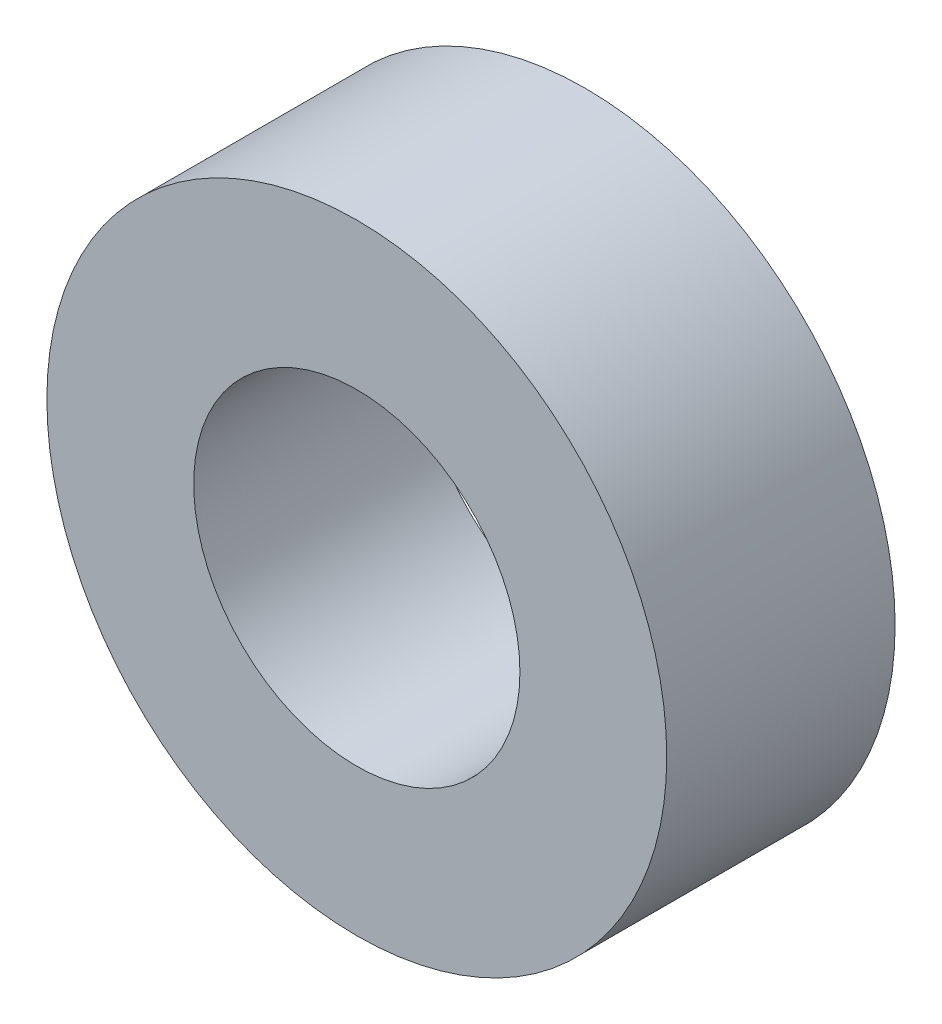
ISO-10303-21;
HEADER;
FILE_DESCRIPTION(('STEP AP214'),'2;1');
FILE_NAME('part.step','',(''),(''),'','','');
FILE_SCHEMA(('AUTOMOTIVE_DESIGN { 1 0 10303 214 1 1 1 1 }'));
ENDSEC;
DATA;
#1=APPLICATION_CONTEXT('core data for automotive mechanical design processes');
#2=APPLICATION_PROTOCOL_DEFINITION('international standard','automotive_design',2000,#1);
#3=PRODUCT_CONTEXT('',#1,'mechanical');
#4=PRODUCT('Part','Part','',(#3));
#5=PRODUCT_RELATED_PRODUCT_CATEGORY('part','',(#4));
#6=PRODUCT_DEFINITION_FORMATION('','',#4);
#7=PRODUCT_DEFINITION_CONTEXT('part definition',#1,'design');
#8=PRODUCT_DEFINITION('design','',#6,#7);
#9=PRODUCT_DEFINITION_SHAPE('','',#8);
#10=(LENGTH_UNIT() NAMED_UNIT(*) SI_UNIT(.MILLI.,.METRE.));
#11=(NAMED_UNIT(*) PLANE_ANGLE_UNIT() SI_UNIT($,.RADIAN.));
#12=(NAMED_UNIT(*) SI_UNIT($,.STERADIAN.) SOLID_ANGLE_UNIT());
#13=UNCERTAINTY_MEASURE_WITH_UNIT(LENGTH_MEASURE(1.E-05),#10,'distance_accuracy_value','');
#14=(GEOMETRIC_REPRESENTATION_CONTEXT(3) GLOBAL_UNCERTAINTY_ASSIGNED_CONTEXT((#13)) GLOBAL_UNIT_ASSIGNED_CONTEXT((#10,
#11,#12)) REPRESENTATION_CONTEXT('',''));
#15=CARTESIAN_POINT('',(0.,0.,0.));
#16=DIRECTION('',(0.,0.,1.));
#17=DIRECTION('',(1.,0.,0.));
#18=AXIS2_PLACEMENT_3D('',#15,#16,#17);
#19=CARTESIAN_POINT('',(0.,0.,7.));
#20=DIRECTION('',(0.,0.,1.));
#21=DIRECTION('',(1.,0.,0.));
#22=AXIS2_PLACEMENT_3D('',#19,#20,#21);
#23=PLANE('',#22);
#24=CARTESIAN_POINT('',(0.,0.,7.));
#25=DIRECTION('',(0.,0.,1.));
#26=DIRECTION('',(1.,0.,0.));
#27=AXIS2_PLACEMENT_3D('',#24,#25,#26);
#28=CIRCLE('',#27,9.5);
#29=CARTESIAN_POINT('',(9.5,0.,7.));
#30=VERTEX_POINT('',#29);
#31=EDGE_CURVE('E10',#30,#30,#28,.T.);
#32=ORIENTED_EDGE('',*,*,#31,.T.);
#33=EDGE_LOOP('',(#32));
#34=FACE_BOUND('',#33,.T.);
#35=CARTESIAN_POINT('',(0.,0.,7.));
#36=DIRECTION('',(0.,0.,1.));
#37=DIRECTION('',(1.,0.,0.));
#38=AXIS2_PLACEMENT_3D('',#35,#36,#37);
#39=CIRCLE('',#38,5.);
#40=CARTESIAN_POINT('',(5.,0.,7.));
#41=VERTEX_POINT('',#40);
#42=EDGE_CURVE('E40',#41,#41,#39,.T.);
#43=ORIENTED_EDGE('',*,*,#42,.F.);
#44=EDGE_LOOP('',(#43));
#45=FACE_BOUND('',#44,.T.);
#46=ADVANCED_FACE('F29',(#34,#45),#23,.T.);
#47=CARTESIAN_POINT('',(0.,0.,0.));
#48=DIRECTION('',(0.,0.,1.));
#49=DIRECTION('',(1.,0.,0.));
#50=AXIS2_PLACEMENT_3D('',#47,#48,#49);
#51=PLANE('',#50);
#52=CARTESIAN_POINT('',(0.,0.,0.));
#53=DIRECTION('',(0.,0.,1.));
#54=DIRECTION('',(1.,0.,0.));
#55=AXIS2_PLACEMENT_3D('',#52,#53,#54);
#56=CIRCLE('',#55,9.5);
#57=CARTESIAN_POINT('',(9.5,0.,0.));
#58=VERTEX_POINT('',#57);
#59=EDGE_CURVE('E33',#58,#58,#56,.T.);
#60=ORIENTED_EDGE('',*,*,#59,.F.);
#61=EDGE_LOOP('',(#60));
#62=FACE_BOUND('',#61,.T.);
#63=CARTESIAN_POINT('',(0.,0.,0.));
#64=DIRECTION('',(0.,0.,1.));
#65=DIRECTION('',(1.,0.,0.));
#66=AXIS2_PLACEMENT_3D('',#63,#64,#65);
#67=CIRCLE('',#66,5.);
#68=CARTESIAN_POINT('',(5.,0.,0.));
#69=VERTEX_POINT('',#68);
#70=EDGE_CURVE('E42',#69,#69,#67,.T.);
#71=ORIENTED_EDGE('',*,*,#70,.T.);
#72=EDGE_LOOP('',(#71));
#73=FACE_BOUND('',#72,.T.);
#74=ADVANCED_FACE('F52',(#62,#73),#51,.F.);
#75=CARTESIAN_POINT('',(0.,0.,7.));
#76=DIRECTION('',(0.,0.,-1.));
#77=DIRECTION('',(-1.,0.,0.));
#78=AXIS2_PLACEMENT_3D('',#75,#76,#77);
#79=CYLINDRICAL_SURFACE('',#78,9.5);
#80=ORIENTED_EDGE('',*,*,#31,.F.);
#81=EDGE_LOOP('',(#80));
#82=FACE_BOUND('',#81,.T.);
#83=ORIENTED_EDGE('',*,*,#59,.T.);
#84=EDGE_LOOP('',(#83));
#85=FACE_BOUND('',#84,.T.);
#86=ADVANCED_FACE('F31',(#82,#85),#79,.T.);
#87=CARTESIAN_POINT('',(0.,0.,7.));
#88=DIRECTION('',(0.,0.,-1.));
#89=DIRECTION('',(-1.,0.,0.));
#90=AXIS2_PLACEMENT_3D('',#87,#88,#89);
#91=CYLINDRICAL_SURFACE('',#90,5.);
#92=ORIENTED_EDGE('',*,*,#42,.T.);
#93=EDGE_LOOP('',(#92));
#94=FACE_BOUND('',#93,.T.);
#95=ORIENTED_EDGE('',*,*,#70,.F.);
#96=EDGE_LOOP('',(#95));
#97=FACE_BOUND('',#96,.T.);
#98=ADVANCED_FACE('F48',(#94,#97),#91,.F.);
#99=CLOSED_SHELL('',(#46,#74,#86,#98));
#100=MANIFOLD_SOLID_BREP('B2',#99);
#101=ADVANCED_BREP_SHAPE_REPRESENTATION('',(#18,#100),#14);
#102=SHAPE_DEFINITION_REPRESENTATION(#9,#101);
ENDSEC;
END-ISO-10303-21;
